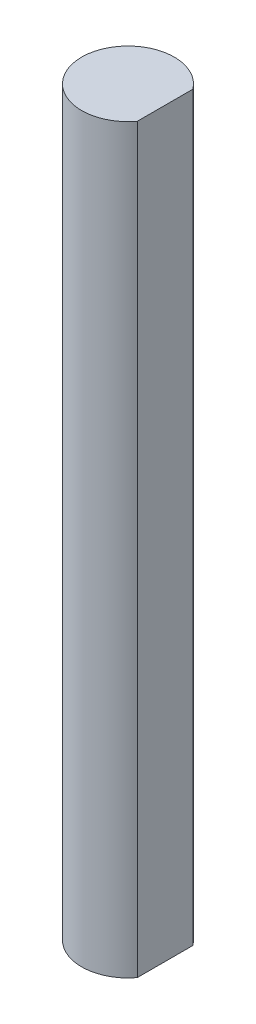
ISO-10303-21;
HEADER;
FILE_DESCRIPTION(('STEP AP214'),'2;1');
FILE_NAME('part.step','',(''),(''),'','','');
FILE_SCHEMA(('AUTOMOTIVE_DESIGN { 1 0 10303 214 1 1 1 1 }'));
ENDSEC;
DATA;
#1=APPLICATION_CONTEXT('core data for automotive mechanical design processes');
#2=APPLICATION_PROTOCOL_DEFINITION('international standard','automotive_design',2000,#1);
#3=PRODUCT_CONTEXT('',#1,'mechanical');
#4=PRODUCT('Part','Part','',(#3));
#5=PRODUCT_RELATED_PRODUCT_CATEGORY('part','',(#4));
#6=PRODUCT_DEFINITION_FORMATION('','',#4);
#7=PRODUCT_DEFINITION_CONTEXT('part definition',#1,'design');
#8=PRODUCT_DEFINITION('design','',#6,#7);
#9=PRODUCT_DEFINITION_SHAPE('','',#8);
#10=(LENGTH_UNIT() NAMED_UNIT(*) SI_UNIT(.MILLI.,.METRE.));
#11=(NAMED_UNIT(*) PLANE_ANGLE_UNIT() SI_UNIT($,.RADIAN.));
#12=(NAMED_UNIT(*) SI_UNIT($,.STERADIAN.) SOLID_ANGLE_UNIT());
#13=UNCERTAINTY_MEASURE_WITH_UNIT(LENGTH_MEASURE(1.E-05),#10,'distance_accuracy_value','');
#14=(GEOMETRIC_REPRESENTATION_CONTEXT(3) GLOBAL_UNCERTAINTY_ASSIGNED_CONTEXT((#13)) GLOBAL_UNIT_ASSIGNED_CONTEXT((#10,
#11,#12)) REPRESENTATION_CONTEXT('',''));
#15=CARTESIAN_POINT('',(0.,0.,0.));
#16=DIRECTION('',(0.,0.,1.));
#17=DIRECTION('',(1.,0.,0.));
#18=AXIS2_PLACEMENT_3D('',#15,#16,#17);
#19=CARTESIAN_POINT('',(0.,50.8,0.));
#20=DIRECTION('',(0.,-1.,0.));
#21=DIRECTION('',(0.,0.,-1.));
#22=AXIS2_PLACEMENT_3D('',#19,#20,#21);
#23=CYLINDRICAL_SURFACE('',#22,3.175);
#24=CARTESIAN_POINT('',(0.,0.,0.));
#25=DIRECTION('',(0.,1.,0.));
#26=DIRECTION('',(0.,0.,1.));
#27=AXIS2_PLACEMENT_3D('',#24,#25,#26);
#28=CIRCLE('',#27,3.175);
#29=CARTESIAN_POINT('',(2.54,0.,-1.905));
#30=VERTEX_POINT('',#29);
#31=CARTESIAN_POINT('',(2.54,0.,1.905));
#32=VERTEX_POINT('',#31);
#33=EDGE_CURVE('E64',#30,#32,#28,.T.);
#34=ORIENTED_EDGE('',*,*,#33,.T.);
#35=DIRECTION('',(0.,-1.,0.));
#36=VECTOR('',#35,1.);
#37=CARTESIAN_POINT('',(2.54,50.8,1.905));
#38=LINE('',#37,#36);
#39=CARTESIAN_POINT('',(2.54,50.8,1.905));
#40=VERTEX_POINT('',#39);
#41=EDGE_CURVE('E11',#40,#32,#38,.T.);
#42=ORIENTED_EDGE('',*,*,#41,.F.);
#43=CARTESIAN_POINT('',(0.,50.8,0.));
#44=DIRECTION('',(0.,1.,0.));
#45=DIRECTION('',(0.,0.,1.));
#46=AXIS2_PLACEMENT_3D('',#43,#44,#45);
#47=CIRCLE('',#46,3.175);
#48=CARTESIAN_POINT('',(2.54,50.8,-1.905));
#49=VERTEX_POINT('',#48);
#50=EDGE_CURVE('E66',#49,#40,#47,.T.);
#51=ORIENTED_EDGE('',*,*,#50,.F.);
#52=DIRECTION('',(0.,-1.,0.));
#53=VECTOR('',#52,1.);
#54=CARTESIAN_POINT('',(2.54,50.8,-1.905));
#55=LINE('',#54,#53);
#56=EDGE_CURVE('E48',#49,#30,#55,.T.);
#57=ORIENTED_EDGE('',*,*,#56,.T.);
#58=EDGE_LOOP('',(#34,#42,#51,#57));
#59=FACE_BOUND('',#58,.T.);
#60=ADVANCED_FACE('F39',(#59),#23,.T.);
#61=CARTESIAN_POINT('',(2.54,50.8,0.));
#62=DIRECTION('',(1.,0.,0.));
#63=DIRECTION('',(0.,0.,-1.));
#64=AXIS2_PLACEMENT_3D('',#61,#62,#63);
#65=PLANE('',#64);
#66=DIRECTION('',(0.,0.,1.));
#67=VECTOR('',#66,1.);
#68=CARTESIAN_POINT('',(2.54,0.,0.));
#69=LINE('',#68,#67);
#70=EDGE_CURVE('E72',#30,#32,#69,.T.);
#71=ORIENTED_EDGE('',*,*,#70,.F.);
#72=ORIENTED_EDGE('',*,*,#56,.F.);
#73=DIRECTION('',(0.,0.,1.));
#74=VECTOR('',#73,1.);
#75=CARTESIAN_POINT('',(2.54,50.8,0.));
#76=LINE('',#75,#74);
#77=EDGE_CURVE('E69',#49,#40,#76,.T.);
#78=ORIENTED_EDGE('',*,*,#77,.T.);
#79=ORIENTED_EDGE('',*,*,#41,.T.);
#80=EDGE_LOOP('',(#71,#72,#78,#79));
#81=FACE_BOUND('',#80,.T.);
#82=ADVANCED_FACE('F75',(#81),#65,.T.);
#83=CARTESIAN_POINT('',(0.,50.8,0.));
#84=DIRECTION('',(0.,1.,0.));
#85=DIRECTION('',(0.,0.,1.));
#86=AXIS2_PLACEMENT_3D('',#83,#84,#85);
#87=PLANE('',#86);
#88=ORIENTED_EDGE('',*,*,#50,.T.);
#89=ORIENTED_EDGE('',*,*,#77,.F.);
#90=EDGE_LOOP('',(#88,#89));
#91=FACE_BOUND('',#90,.T.);
#92=ADVANCED_FACE('F83',(#91),#87,.T.);
#93=CARTESIAN_POINT('',(0.,0.,0.));
#94=DIRECTION('',(0.,1.,0.));
#95=DIRECTION('',(0.,0.,1.));
#96=AXIS2_PLACEMENT_3D('',#93,#94,#95);
#97=PLANE('',#96);
#98=ORIENTED_EDGE('',*,*,#33,.F.);
#99=ORIENTED_EDGE('',*,*,#70,.T.);
#100=EDGE_LOOP('',(#98,#99));
#101=FACE_BOUND('',#100,.T.);
#102=ADVANCED_FACE('F71',(#101),#97,.F.);
#103=CLOSED_SHELL('',(#60,#82,#92,#102));
#104=MANIFOLD_SOLID_BREP('B2',#103);
#105=ADVANCED_BREP_SHAPE_REPRESENTATION('',(#18,#104),#14);
#106=SHAPE_DEFINITION_REPRESENTATION(#9,#105);
ENDSEC;
END-ISO-10303-21;
